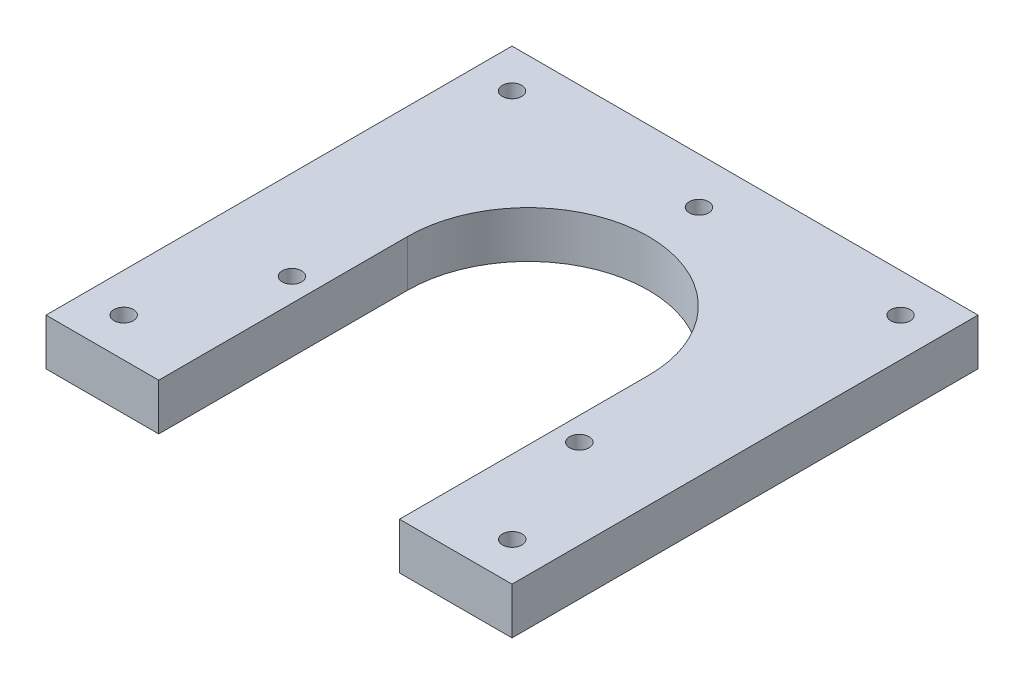
ISO-10303-21;
HEADER;
FILE_DESCRIPTION(('STEP AP214'),'2;1');
FILE_NAME('part.step','',(''),(''),'','','');
FILE_SCHEMA(('AUTOMOTIVE_DESIGN { 1 0 10303 214 1 1 1 1 }'));
ENDSEC;
DATA;
#1=APPLICATION_CONTEXT('core data for automotive mechanical design processes');
#2=APPLICATION_PROTOCOL_DEFINITION('international standard','automotive_design',2000,#1);
#3=PRODUCT_CONTEXT('',#1,'mechanical');
#4=PRODUCT('Part','Part','',(#3));
#5=PRODUCT_RELATED_PRODUCT_CATEGORY('part','',(#4));
#6=PRODUCT_DEFINITION_FORMATION('','',#4);
#7=PRODUCT_DEFINITION_CONTEXT('part definition',#1,'design');
#8=PRODUCT_DEFINITION('design','',#6,#7);
#9=PRODUCT_DEFINITION_SHAPE('','',#8);
#10=(LENGTH_UNIT() NAMED_UNIT(*) SI_UNIT(.MILLI.,.METRE.));
#11=(NAMED_UNIT(*) PLANE_ANGLE_UNIT() SI_UNIT($,.RADIAN.));
#12=(NAMED_UNIT(*) SI_UNIT($,.STERADIAN.) SOLID_ANGLE_UNIT());
#13=UNCERTAINTY_MEASURE_WITH_UNIT(LENGTH_MEASURE(1.E-05),#10,'distance_accuracy_value','');
#14=(GEOMETRIC_REPRESENTATION_CONTEXT(3) GLOBAL_UNCERTAINTY_ASSIGNED_CONTEXT((#13)) GLOBAL_UNIT_ASSIGNED_CONTEXT((#10,
#11,#12)) REPRESENTATION_CONTEXT('',''));
#15=CARTESIAN_POINT('',(0.,0.,0.));
#16=DIRECTION('',(0.,0.,1.));
#17=DIRECTION('',(1.,0.,0.));
#18=AXIS2_PLACEMENT_3D('',#15,#16,#17);
#19=CARTESIAN_POINT('',(0.,0.,63.));
#20=DIRECTION('',(0.,0.,1.));
#21=DIRECTION('',(1.,0.,0.));
#22=AXIS2_PLACEMENT_3D('',#19,#20,#21);
#23=PLANE('',#22);
#24=DIRECTION('',(0.,1.,0.));
#25=VECTOR('',#24,1.);
#26=CARTESIAN_POINT('',(31.5127197729334,0.,63.));
#27=LINE('',#26,#25);
#28=CARTESIAN_POINT('',(31.5127197729334,0.,63.));
#29=VERTEX_POINT('',#28);
#30=CARTESIAN_POINT('',(31.5127197729334,6.,63.));
#31=VERTEX_POINT('',#30);
#32=EDGE_CURVE('E11',#29,#31,#27,.T.);
#33=ORIENTED_EDGE('',*,*,#32,.F.);
#34=DIRECTION('',(1.,0.,0.));
#35=VECTOR('',#34,1.);
#36=CARTESIAN_POINT('',(-14.,0.,63.));
#37=LINE('',#36,#35);
#38=CARTESIAN_POINT('',(46.,0.,63.));
#39=VERTEX_POINT('',#38);
#40=EDGE_CURVE('E267',#29,#39,#37,.T.);
#41=ORIENTED_EDGE('',*,*,#40,.T.);
#42=DIRECTION('',(0.,1.,0.));
#43=VECTOR('',#42,1.);
#44=CARTESIAN_POINT('',(46.,6.,63.));
#45=LINE('',#44,#43);
#46=CARTESIAN_POINT('',(46.,6.,63.));
#47=VERTEX_POINT('',#46);
#48=EDGE_CURVE('E270',#39,#47,#45,.T.);
#49=ORIENTED_EDGE('',*,*,#48,.T.);
#50=DIRECTION('',(-1.,0.,0.));
#51=VECTOR('',#50,1.);
#52=CARTESIAN_POINT('',(-14.,6.,63.));
#53=LINE('',#52,#51);
#54=EDGE_CURVE('E273',#47,#31,#53,.T.);
#55=ORIENTED_EDGE('',*,*,#54,.T.);
#56=EDGE_LOOP('',(#33,#41,#49,#55));
#57=FACE_BOUND('',#56,.T.);
#58=ADVANCED_FACE('F51',(#57),#23,.T.);
#59=CARTESIAN_POINT('',(-14.,6.,63.));
#60=DIRECTION('',(1.,0.,0.));
#61=DIRECTION('',(0.,0.,-1.));
#62=AXIS2_PLACEMENT_3D('',#59,#60,#61);
#63=PLANE('',#62);
#64=CARTESIAN_POINT('',(-14.,3.,14.94));
#65=DIRECTION('',(-1.,0.,0.));
#66=DIRECTION('',(0.,0.,1.));
#67=AXIS2_PLACEMENT_3D('',#64,#65,#66);
#68=CIRCLE('',#67,1.24999999999999);
#69=CARTESIAN_POINT('',(-14.,3.,16.19));
#70=VERTEX_POINT('',#69);
#71=EDGE_CURVE('E149',#70,#70,#68,.T.);
#72=ORIENTED_EDGE('',*,*,#71,.F.);
#73=EDGE_LOOP('',(#72));
#74=FACE_BOUND('',#73,.T.);
#75=CARTESIAN_POINT('',(-14.,3.,46.94));
#76=DIRECTION('',(-1.,0.,0.));
#77=DIRECTION('',(0.,0.,1.));
#78=AXIS2_PLACEMENT_3D('',#75,#76,#77);
#79=CIRCLE('',#78,1.24999999999999);
#80=CARTESIAN_POINT('',(-14.,3.,48.19));
#81=VERTEX_POINT('',#80);
#82=EDGE_CURVE('E148',#81,#81,#79,.T.);
#83=ORIENTED_EDGE('',*,*,#82,.F.);
#84=EDGE_LOOP('',(#83));
#85=FACE_BOUND('',#84,.T.);
#86=DIRECTION('',(0.,-1.,0.));
#87=VECTOR('',#86,1.);
#88=CARTESIAN_POINT('',(-14.,6.,3.));
#89=LINE('',#88,#87);
#90=CARTESIAN_POINT('',(-14.,6.,3.));
#91=VERTEX_POINT('',#90);
#92=CARTESIAN_POINT('',(-14.,0.,3.));
#93=VERTEX_POINT('',#92);
#94=EDGE_CURVE('E263',#91,#93,#89,.T.);
#95=ORIENTED_EDGE('',*,*,#94,.T.);
#96=DIRECTION('',(0.,0.,-1.));
#97=VECTOR('',#96,1.);
#98=CARTESIAN_POINT('',(-14.,0.,63.));
#99=LINE('',#98,#97);
#100=CARTESIAN_POINT('',(-14.,0.,63.));
#101=VERTEX_POINT('',#100);
#102=EDGE_CURVE('E298',#101,#93,#99,.T.);
#103=ORIENTED_EDGE('',*,*,#102,.F.);
#104=DIRECTION('',(0.,-1.,0.));
#105=VECTOR('',#104,1.);
#106=CARTESIAN_POINT('',(-14.,6.,63.));
#107=LINE('',#106,#105);
#108=CARTESIAN_POINT('',(-14.,6.,63.));
#109=VERTEX_POINT('',#108);
#110=EDGE_CURVE('E264',#109,#101,#107,.T.);
#111=ORIENTED_EDGE('',*,*,#110,.F.);
#112=DIRECTION('',(0.,0.,-1.));
#113=VECTOR('',#112,1.);
#114=CARTESIAN_POINT('',(-14.,6.,63.));
#115=LINE('',#114,#113);
#116=EDGE_CURVE('E277',#109,#91,#115,.T.);
#117=ORIENTED_EDGE('',*,*,#116,.T.);
#118=EDGE_LOOP('',(#95,#103,#111,#117));
#119=FACE_BOUND('',#118,.T.);
#120=ADVANCED_FACE('F53',(#74,#85,#119),#63,.F.);
#121=CARTESIAN_POINT('',(-14.,0.,63.));
#122=DIRECTION('',(0.,1.,0.));
#123=DIRECTION('',(0.,0.,1.));
#124=AXIS2_PLACEMENT_3D('',#121,#122,#123);
#125=PLANE('',#124);
#126=CARTESIAN_POINT('',(-9.,0.,58.));
#127=DIRECTION('',(0.,-1.,0.));
#128=DIRECTION('',(0.,0.,-1.));
#129=AXIS2_PLACEMENT_3D('',#126,#127,#128);
#130=CIRCLE('',#129,1.25);
#131=CARTESIAN_POINT('',(-9.,0.,56.75));
#132=VERTEX_POINT('',#131);
#133=EDGE_CURVE('E164',#132,#132,#130,.T.);
#134=ORIENTED_EDGE('',*,*,#133,.F.);
#135=EDGE_LOOP('',(#134));
#136=FACE_BOUND('',#135,.T.);
#137=CARTESIAN_POINT('',(-8.99999999999999,0.,8.));
#138=DIRECTION('',(0.,-1.,0.));
#139=DIRECTION('',(0.,0.,-1.));
#140=AXIS2_PLACEMENT_3D('',#137,#138,#139);
#141=CIRCLE('',#140,1.25);
#142=CARTESIAN_POINT('',(-8.99999999999999,0.,6.75));
#143=VERTEX_POINT('',#142);
#144=EDGE_CURVE('E172',#143,#143,#141,.T.);
#145=ORIENTED_EDGE('',*,*,#144,.F.);
#146=EDGE_LOOP('',(#145));
#147=FACE_BOUND('',#146,.T.);
#148=CARTESIAN_POINT('',(41.0254395458668,0.,8.));
#149=DIRECTION('',(0.,-1.,0.));
#150=DIRECTION('',(0.,0.,-1.));
#151=AXIS2_PLACEMENT_3D('',#148,#149,#150);
#152=CIRCLE('',#151,1.25);
#153=CARTESIAN_POINT('',(41.0254395458668,0.,6.75));
#154=VERTEX_POINT('',#153);
#155=EDGE_CURVE('E180',#154,#154,#152,.T.);
#156=ORIENTED_EDGE('',*,*,#155,.F.);
#157=EDGE_LOOP('',(#156));
#158=FACE_BOUND('',#157,.T.);
#159=CARTESIAN_POINT('',(41.0254395458668,0.,58.));
#160=DIRECTION('',(0.,-1.,0.));
#161=DIRECTION('',(0.,0.,-1.));
#162=AXIS2_PLACEMENT_3D('',#159,#160,#161);
#163=CIRCLE('',#162,1.25);
#164=CARTESIAN_POINT('',(41.0254395458668,0.,56.75));
#165=VERTEX_POINT('',#164);
#166=EDGE_CURVE('E188',#165,#165,#163,.T.);
#167=ORIENTED_EDGE('',*,*,#166,.F.);
#168=EDGE_LOOP('',(#167));
#169=FACE_BOUND('',#168,.T.);
#170=CARTESIAN_POINT('',(-2.48728022706658,0.,42.8458808997907));
#171=DIRECTION('',(0.,-1.,0.));
#172=DIRECTION('',(0.,0.,-1.));
#173=AXIS2_PLACEMENT_3D('',#170,#171,#172);
#174=CIRCLE('',#173,1.25);
#175=CARTESIAN_POINT('',(-2.48728022706658,0.,41.5958808997906));
#176=VERTEX_POINT('',#175);
#177=EDGE_CURVE('E196',#176,#176,#174,.T.);
#178=ORIENTED_EDGE('',*,*,#177,.F.);
#179=EDGE_LOOP('',(#178));
#180=FACE_BOUND('',#179,.T.);
#181=CARTESIAN_POINT('',(16.0127197729334,0.,8.94));
#182=DIRECTION('',(0.,-1.,0.));
#183=DIRECTION('',(0.,0.,-1.));
#184=AXIS2_PLACEMENT_3D('',#181,#182,#183);
#185=CIRCLE('',#184,1.25);
#186=CARTESIAN_POINT('',(16.0127197729334,0.,7.69));
#187=VERTEX_POINT('',#186);
#188=EDGE_CURVE('E204',#187,#187,#185,.T.);
#189=ORIENTED_EDGE('',*,*,#188,.F.);
#190=EDGE_LOOP('',(#189));
#191=FACE_BOUND('',#190,.T.);
#192=CARTESIAN_POINT('',(34.5127197729334,0.,42.8458808997907));
#193=DIRECTION('',(0.,-1.,0.));
#194=DIRECTION('',(0.,0.,-1.));
#195=AXIS2_PLACEMENT_3D('',#192,#193,#194);
#196=CIRCLE('',#195,1.25);
#197=CARTESIAN_POINT('',(34.5127197729334,0.,41.5958808997907));
#198=VERTEX_POINT('',#197);
#199=EDGE_CURVE('E212',#198,#198,#196,.T.);
#200=ORIENTED_EDGE('',*,*,#199,.F.);
#201=EDGE_LOOP('',(#200));
#202=FACE_BOUND('',#201,.T.);
#203=ORIENTED_EDGE('',*,*,#40,.F.);
#204=DIRECTION('',(0.,0.,-1.));
#205=VECTOR('',#204,1.);
#206=CARTESIAN_POINT('',(31.5127197729334,0.,63.));
#207=LINE('',#206,#205);
#208=CARTESIAN_POINT('',(31.5127197729334,0.,30.94));
#209=VERTEX_POINT('',#208);
#210=EDGE_CURVE('E239',#29,#209,#207,.T.);
#211=ORIENTED_EDGE('',*,*,#210,.T.);
#212=CARTESIAN_POINT('',(16.0127197729334,0.,30.94));
#213=DIRECTION('',(0.,1.,0.));
#214=DIRECTION('',(0.,0.,1.));
#215=AXIS2_PLACEMENT_3D('',#212,#213,#214);
#216=CIRCLE('',#215,15.5);
#217=CARTESIAN_POINT('',(0.512719772933413,0.,30.94));
#218=VERTEX_POINT('',#217);
#219=EDGE_CURVE('E243',#209,#218,#216,.T.);
#220=ORIENTED_EDGE('',*,*,#219,.T.);
#221=DIRECTION('',(0.,0.,1.));
#222=VECTOR('',#221,1.);
#223=CARTESIAN_POINT('',(0.512719772933422,0.,63.));
#224=LINE('',#223,#222);
#225=CARTESIAN_POINT('',(0.512719772933422,0.,63.));
#226=VERTEX_POINT('',#225);
#227=EDGE_CURVE('E234',#218,#226,#224,.T.);
#228=ORIENTED_EDGE('',*,*,#227,.T.);
#229=EDGE_CURVE('E105',#101,#226,#37,.T.);
#230=ORIENTED_EDGE('',*,*,#229,.F.);
#231=ORIENTED_EDGE('',*,*,#102,.T.);
#232=DIRECTION('',(1.,0.,0.));
#233=VECTOR('',#232,1.);
#234=CARTESIAN_POINT('',(-14.,0.,3.));
#235=LINE('',#234,#233);
#236=CARTESIAN_POINT('',(46.,0.,3.));
#237=VERTEX_POINT('',#236);
#238=EDGE_CURVE('E281',#93,#237,#235,.T.);
#239=ORIENTED_EDGE('',*,*,#238,.T.);
#240=DIRECTION('',(0.,0.,-1.));
#241=VECTOR('',#240,1.);
#242=CARTESIAN_POINT('',(46.,0.,63.));
#243=LINE('',#242,#241);
#244=EDGE_CURVE('E294',#39,#237,#243,.T.);
#245=ORIENTED_EDGE('',*,*,#244,.F.);
#246=EDGE_LOOP('',(#203,#211,#220,#228,#230,#231,#239,#245));
#247=FACE_BOUND('',#246,.T.);
#248=ADVANCED_FACE('F306',(#136,#147,#158,#169,#180,#191,#202,#247),#125,.F.);
#249=CARTESIAN_POINT('',(46.,6.,63.));
#250=DIRECTION('',(-1.,0.,0.));
#251=DIRECTION('',(0.,0.,1.));
#252=AXIS2_PLACEMENT_3D('',#249,#250,#251);
#253=PLANE('',#252);
#254=DIRECTION('',(0.,1.,0.));
#255=VECTOR('',#254,1.);
#256=CARTESIAN_POINT('',(46.,6.,3.));
#257=LINE('',#256,#255);
#258=CARTESIAN_POINT('',(46.,6.,3.));
#259=VERTEX_POINT('',#258);
#260=EDGE_CURVE('E284',#237,#259,#257,.T.);
#261=ORIENTED_EDGE('',*,*,#260,.T.);
#262=DIRECTION('',(0.,0.,-1.));
#263=VECTOR('',#262,1.);
#264=CARTESIAN_POINT('',(46.,6.,63.));
#265=LINE('',#264,#263);
#266=EDGE_CURVE('E291',#47,#259,#265,.T.);
#267=ORIENTED_EDGE('',*,*,#266,.F.);
#268=ORIENTED_EDGE('',*,*,#48,.F.);
#269=ORIENTED_EDGE('',*,*,#244,.T.);
#270=EDGE_LOOP('',(#261,#267,#268,#269));
#271=FACE_BOUND('',#270,.T.);
#272=ADVANCED_FACE('F317',(#271),#253,.F.);
#273=CARTESIAN_POINT('',(-14.,6.,63.));
#274=DIRECTION('',(0.,-1.,0.));
#275=DIRECTION('',(0.,0.,-1.));
#276=AXIS2_PLACEMENT_3D('',#273,#274,#275);
#277=PLANE('',#276);
#278=CARTESIAN_POINT('',(-9.,6.,58.));
#279=DIRECTION('',(0.,-1.,0.));
#280=DIRECTION('',(0.,0.,-1.));
#281=AXIS2_PLACEMENT_3D('',#278,#279,#280);
#282=CIRCLE('',#281,1.25);
#283=CARTESIAN_POINT('',(-9.,6.,56.75));
#284=VERTEX_POINT('',#283);
#285=EDGE_CURVE('E168',#284,#284,#282,.T.);
#286=ORIENTED_EDGE('',*,*,#285,.T.);
#287=EDGE_LOOP('',(#286));
#288=FACE_BOUND('',#287,.T.);
#289=CARTESIAN_POINT('',(-8.99999999999999,6.,8.));
#290=DIRECTION('',(0.,-1.,0.));
#291=DIRECTION('',(0.,0.,-1.));
#292=AXIS2_PLACEMENT_3D('',#289,#290,#291);
#293=CIRCLE('',#292,1.25);
#294=CARTESIAN_POINT('',(-8.99999999999999,6.,6.75));
#295=VERTEX_POINT('',#294);
#296=EDGE_CURVE('E176',#295,#295,#293,.T.);
#297=ORIENTED_EDGE('',*,*,#296,.T.);
#298=EDGE_LOOP('',(#297));
#299=FACE_BOUND('',#298,.T.);
#300=CARTESIAN_POINT('',(41.0254395458668,6.,8.));
#301=DIRECTION('',(0.,-1.,0.));
#302=DIRECTION('',(0.,0.,-1.));
#303=AXIS2_PLACEMENT_3D('',#300,#301,#302);
#304=CIRCLE('',#303,1.25);
#305=CARTESIAN_POINT('',(41.0254395458668,6.,6.75));
#306=VERTEX_POINT('',#305);
#307=EDGE_CURVE('E184',#306,#306,#304,.T.);
#308=ORIENTED_EDGE('',*,*,#307,.T.);
#309=EDGE_LOOP('',(#308));
#310=FACE_BOUND('',#309,.T.);
#311=CARTESIAN_POINT('',(41.0254395458668,6.,58.));
#312=DIRECTION('',(0.,-1.,0.));
#313=DIRECTION('',(0.,0.,-1.));
#314=AXIS2_PLACEMENT_3D('',#311,#312,#313);
#315=CIRCLE('',#314,1.25);
#316=CARTESIAN_POINT('',(41.0254395458668,6.,56.75));
#317=VERTEX_POINT('',#316);
#318=EDGE_CURVE('E192',#317,#317,#315,.T.);
#319=ORIENTED_EDGE('',*,*,#318,.T.);
#320=EDGE_LOOP('',(#319));
#321=FACE_BOUND('',#320,.T.);
#322=CARTESIAN_POINT('',(-2.48728022706658,6.,42.8458808997907));
#323=DIRECTION('',(0.,-1.,0.));
#324=DIRECTION('',(0.,0.,-1.));
#325=AXIS2_PLACEMENT_3D('',#322,#323,#324);
#326=CIRCLE('',#325,1.25);
#327=CARTESIAN_POINT('',(-2.48728022706658,6.,41.5958808997906));
#328=VERTEX_POINT('',#327);
#329=EDGE_CURVE('E200',#328,#328,#326,.T.);
#330=ORIENTED_EDGE('',*,*,#329,.T.);
#331=EDGE_LOOP('',(#330));
#332=FACE_BOUND('',#331,.T.);
#333=CARTESIAN_POINT('',(16.0127197729334,6.,8.94));
#334=DIRECTION('',(0.,-1.,0.));
#335=DIRECTION('',(0.,0.,-1.));
#336=AXIS2_PLACEMENT_3D('',#333,#334,#335);
#337=CIRCLE('',#336,1.25);
#338=CARTESIAN_POINT('',(16.0127197729334,6.,7.69));
#339=VERTEX_POINT('',#338);
#340=EDGE_CURVE('E208',#339,#339,#337,.T.);
#341=ORIENTED_EDGE('',*,*,#340,.T.);
#342=EDGE_LOOP('',(#341));
#343=FACE_BOUND('',#342,.T.);
#344=CARTESIAN_POINT('',(34.5127197729334,6.,42.8458808997907));
#345=DIRECTION('',(0.,-1.,0.));
#346=DIRECTION('',(0.,0.,-1.));
#347=AXIS2_PLACEMENT_3D('',#344,#345,#346);
#348=CIRCLE('',#347,1.25);
#349=CARTESIAN_POINT('',(34.5127197729334,6.,41.5958808997907));
#350=VERTEX_POINT('',#349);
#351=EDGE_CURVE('E216',#350,#350,#348,.T.);
#352=ORIENTED_EDGE('',*,*,#351,.T.);
#353=EDGE_LOOP('',(#352));
#354=FACE_BOUND('',#353,.T.);
#355=CARTESIAN_POINT('',(16.0127197729334,6.,30.94));
#356=DIRECTION('',(0.,1.,0.));
#357=DIRECTION('',(0.,0.,1.));
#358=AXIS2_PLACEMENT_3D('',#355,#356,#357);
#359=CIRCLE('',#358,15.5);
#360=CARTESIAN_POINT('',(31.5127197729334,6.,30.94));
#361=VERTEX_POINT('',#360);
#362=CARTESIAN_POINT('',(0.512719772933413,6.,30.94));
#363=VERTEX_POINT('',#362);
#364=EDGE_CURVE('E220',#361,#363,#359,.T.);
#365=ORIENTED_EDGE('',*,*,#364,.F.);
#366=DIRECTION('',(0.,0.,-1.));
#367=VECTOR('',#366,1.);
#368=CARTESIAN_POINT('',(31.5127197729334,6.,30.94));
#369=LINE('',#368,#367);
#370=EDGE_CURVE('E226',#31,#361,#369,.T.);
#371=ORIENTED_EDGE('',*,*,#370,.F.);
#372=ORIENTED_EDGE('',*,*,#54,.F.);
#373=ORIENTED_EDGE('',*,*,#266,.T.);
#374=DIRECTION('',(-1.,0.,0.));
#375=VECTOR('',#374,1.);
#376=CARTESIAN_POINT('',(-14.,6.,3.));
#377=LINE('',#376,#375);
#378=EDGE_CURVE('E97',#259,#91,#377,.T.);
#379=ORIENTED_EDGE('',*,*,#378,.T.);
#380=ORIENTED_EDGE('',*,*,#116,.F.);
#381=CARTESIAN_POINT('',(0.512719772933413,6.,63.));
#382=VERTEX_POINT('',#381);
#383=EDGE_CURVE('E75',#382,#109,#53,.T.);
#384=ORIENTED_EDGE('',*,*,#383,.F.);
#385=DIRECTION('',(0.,0.,1.));
#386=VECTOR('',#385,1.);
#387=CARTESIAN_POINT('',(0.512719772933413,6.,30.94));
#388=LINE('',#387,#386);
#389=EDGE_CURVE('E67',#363,#382,#388,.T.);
#390=ORIENTED_EDGE('',*,*,#389,.F.);
#391=EDGE_LOOP('',(#365,#371,#372,#373,#379,#380,#384,#390));
#392=FACE_BOUND('',#391,.T.);
#393=ADVANCED_FACE('F331',(#288,#299,#310,#321,#332,#343,#354,#392),#277,.F.);
#394=DIRECTION('',(0.,-1.,0.));
#395=VECTOR('',#394,1.);
#396=CARTESIAN_POINT('',(0.512719772933422,0.,63.));
#397=LINE('',#396,#395);
#398=EDGE_CURVE('E60',#382,#226,#397,.T.);
#399=ORIENTED_EDGE('',*,*,#398,.F.);
#400=ORIENTED_EDGE('',*,*,#383,.T.);
#401=ORIENTED_EDGE('',*,*,#110,.T.);
#402=ORIENTED_EDGE('',*,*,#229,.T.);
#403=EDGE_LOOP('',(#399,#400,#401,#402));
#404=FACE_BOUND('',#403,.T.);
#405=ADVANCED_FACE('F307',(#404),#23,.T.);
#406=CARTESIAN_POINT('',(0.,0.,3.));
#407=DIRECTION('',(0.,0.,1.));
#408=DIRECTION('',(1.,0.,0.));
#409=AXIS2_PLACEMENT_3D('',#406,#407,#408);
#410=PLANE('',#409);
#411=CARTESIAN_POINT('',(29.,3.,3.));
#412=DIRECTION('',(0.,0.,-1.));
#413=DIRECTION('',(-1.,0.,0.));
#414=AXIS2_PLACEMENT_3D('',#411,#412,#413);
#415=CIRCLE('',#414,1.24999999999999);
#416=CARTESIAN_POINT('',(27.75,3.,3.));
#417=VERTEX_POINT('',#416);
#418=EDGE_CURVE('E247',#417,#417,#415,.T.);
#419=ORIENTED_EDGE('',*,*,#418,.F.);
#420=EDGE_LOOP('',(#419));
#421=FACE_BOUND('',#420,.T.);
#422=CARTESIAN_POINT('',(3.,3.,3.));
#423=DIRECTION('',(0.,0.,-1.));
#424=DIRECTION('',(-1.,0.,0.));
#425=AXIS2_PLACEMENT_3D('',#422,#423,#424);
#426=CIRCLE('',#425,1.24999999999999);
#427=CARTESIAN_POINT('',(1.75000000000001,3.,3.));
#428=VERTEX_POINT('',#427);
#429=EDGE_CURVE('E255',#428,#428,#426,.T.);
#430=ORIENTED_EDGE('',*,*,#429,.F.);
#431=EDGE_LOOP('',(#430));
#432=FACE_BOUND('',#431,.T.);
#433=ORIENTED_EDGE('',*,*,#94,.F.);
#434=ORIENTED_EDGE('',*,*,#378,.F.);
#435=ORIENTED_EDGE('',*,*,#260,.F.);
#436=ORIENTED_EDGE('',*,*,#238,.F.);
#437=EDGE_LOOP('',(#433,#434,#435,#436));
#438=FACE_BOUND('',#437,.T.);
#439=ADVANCED_FACE('F319',(#421,#432,#438),#410,.F.);
#440=CARTESIAN_POINT('',(3.,3.,10.5));
#441=DIRECTION('',(0.,0.,-1.));
#442=DIRECTION('',(-1.,0.,0.));
#443=AXIS2_PLACEMENT_3D('',#440,#441,#442);
#444=CONICAL_SURFACE('',#443,1.24999999999999,1.02974425867665);
#445=CARTESIAN_POINT('',(3.,3.,11.2510757737844));
#446=VERTEX_POINT('',#445);
#447=VERTEX_LOOP('',#446);
#448=FACE_BOUND('',#447,.T.);
#449=CARTESIAN_POINT('',(3.,3.,10.5));
#450=DIRECTION('',(0.,0.,-1.));
#451=DIRECTION('',(-1.,0.,0.));
#452=AXIS2_PLACEMENT_3D('',#449,#450,#451);
#453=CIRCLE('',#452,1.24999999999999);
#454=CARTESIAN_POINT('',(1.75000000000001,3.,10.5));
#455=VERTEX_POINT('',#454);
#456=EDGE_CURVE('E259',#455,#455,#453,.T.);
#457=ORIENTED_EDGE('',*,*,#456,.T.);
#458=EDGE_LOOP('',(#457));
#459=FACE_BOUND('',#458,.T.);
#460=ADVANCED_FACE('F321',(#448,#459),#444,.F.);
#461=CARTESIAN_POINT('',(3.,3.,3.));
#462=DIRECTION('',(0.,0.,-1.));
#463=DIRECTION('',(-1.,0.,0.));
#464=AXIS2_PLACEMENT_3D('',#461,#462,#463);
#465=CYLINDRICAL_SURFACE('',#464,1.24999999999999);
#466=ORIENTED_EDGE('',*,*,#456,.F.);
#467=EDGE_LOOP('',(#466));
#468=FACE_BOUND('',#467,.T.);
#469=ORIENTED_EDGE('',*,*,#429,.T.);
#470=EDGE_LOOP('',(#469));
#471=FACE_BOUND('',#470,.T.);
#472=ADVANCED_FACE('F328',(#468,#471),#465,.F.);
#473=CARTESIAN_POINT('',(29.,3.,10.5));
#474=DIRECTION('',(0.,0.,-1.));
#475=DIRECTION('',(-1.,0.,0.));
#476=AXIS2_PLACEMENT_3D('',#473,#474,#475);
#477=CONICAL_SURFACE('',#476,1.24999999999999,1.02974425867665);
#478=CARTESIAN_POINT('',(29.,3.,11.2510757737844));
#479=VERTEX_POINT('',#478);
#480=VERTEX_LOOP('',#479);
#481=FACE_BOUND('',#480,.T.);
#482=CARTESIAN_POINT('',(29.,3.,10.5));
#483=DIRECTION('',(0.,0.,-1.));
#484=DIRECTION('',(-1.,0.,0.));
#485=AXIS2_PLACEMENT_3D('',#482,#483,#484);
#486=CIRCLE('',#485,1.24999999999999);
#487=CARTESIAN_POINT('',(27.75,3.,10.5));
#488=VERTEX_POINT('',#487);
#489=EDGE_CURVE('E251',#488,#488,#486,.T.);
#490=ORIENTED_EDGE('',*,*,#489,.T.);
#491=EDGE_LOOP('',(#490));
#492=FACE_BOUND('',#491,.T.);
#493=ADVANCED_FACE('F346',(#481,#492),#477,.F.);
#494=CARTESIAN_POINT('',(29.,3.,3.));
#495=DIRECTION('',(0.,0.,-1.));
#496=DIRECTION('',(-1.,0.,0.));
#497=AXIS2_PLACEMENT_3D('',#494,#495,#496);
#498=CYLINDRICAL_SURFACE('',#497,1.24999999999999);
#499=ORIENTED_EDGE('',*,*,#489,.F.);
#500=EDGE_LOOP('',(#499));
#501=FACE_BOUND('',#500,.T.);
#502=ORIENTED_EDGE('',*,*,#418,.T.);
#503=EDGE_LOOP('',(#502));
#504=FACE_BOUND('',#503,.T.);
#505=ADVANCED_FACE('F350',(#501,#504),#498,.F.);
#506=CARTESIAN_POINT('',(16.0127197729334,-54.,30.94));
#507=DIRECTION('',(0.,1.,0.));
#508=DIRECTION('',(0.,0.,1.));
#509=AXIS2_PLACEMENT_3D('',#506,#507,#508);
#510=CYLINDRICAL_SURFACE('',#509,15.5);
#511=DIRECTION('',(0.,1.,0.));
#512=VECTOR('',#511,1.);
#513=CARTESIAN_POINT('',(31.5127197729334,-54.,30.94));
#514=LINE('',#513,#512);
#515=EDGE_CURVE('E231',#209,#361,#514,.T.);
#516=ORIENTED_EDGE('',*,*,#515,.T.);
#517=ORIENTED_EDGE('',*,*,#364,.T.);
#518=DIRECTION('',(0.,1.,0.));
#519=VECTOR('',#518,1.);
#520=CARTESIAN_POINT('',(0.512719772933413,-54.,30.94));
#521=LINE('',#520,#519);
#522=EDGE_CURVE('E230',#218,#363,#521,.T.);
#523=ORIENTED_EDGE('',*,*,#522,.F.);
#524=ORIENTED_EDGE('',*,*,#219,.F.);
#525=EDGE_LOOP('',(#516,#517,#523,#524));
#526=FACE_BOUND('',#525,.T.);
#527=ADVANCED_FACE('F354',(#526),#510,.F.);
#528=CARTESIAN_POINT('',(31.5127197729334,-54.,30.94));
#529=DIRECTION('',(1.,0.,0.));
#530=DIRECTION('',(0.,0.,-1.));
#531=AXIS2_PLACEMENT_3D('',#528,#529,#530);
#532=PLANE('',#531);
#533=ORIENTED_EDGE('',*,*,#32,.T.);
#534=ORIENTED_EDGE('',*,*,#370,.T.);
#535=ORIENTED_EDGE('',*,*,#515,.F.);
#536=ORIENTED_EDGE('',*,*,#210,.F.);
#537=EDGE_LOOP('',(#533,#534,#535,#536));
#538=FACE_BOUND('',#537,.T.);
#539=ADVANCED_FACE('F358',(#538),#532,.F.);
#540=CARTESIAN_POINT('',(0.512719772933413,-54.,30.94));
#541=DIRECTION('',(-1.,0.,0.));
#542=DIRECTION('',(0.,0.,1.));
#543=AXIS2_PLACEMENT_3D('',#540,#541,#542);
#544=PLANE('',#543);
#545=ORIENTED_EDGE('',*,*,#522,.T.);
#546=ORIENTED_EDGE('',*,*,#389,.T.);
#547=ORIENTED_EDGE('',*,*,#398,.T.);
#548=ORIENTED_EDGE('',*,*,#227,.F.);
#549=EDGE_LOOP('',(#545,#546,#547,#548));
#550=FACE_BOUND('',#549,.T.);
#551=ADVANCED_FACE('F303',(#550),#544,.F.);
#552=CARTESIAN_POINT('',(34.5127197729334,0.,42.8458808997907));
#553=DIRECTION('',(0.,-1.,0.));
#554=DIRECTION('',(0.,0.,-1.));
#555=AXIS2_PLACEMENT_3D('',#552,#553,#554);
#556=CYLINDRICAL_SURFACE('',#555,1.25);
#557=ORIENTED_EDGE('',*,*,#351,.F.);
#558=EDGE_LOOP('',(#557));
#559=FACE_BOUND('',#558,.T.);
#560=ORIENTED_EDGE('',*,*,#199,.T.);
#561=EDGE_LOOP('',(#560));
#562=FACE_BOUND('',#561,.T.);
#563=ADVANCED_FACE('F362',(#559,#562),#556,.F.);
#564=CARTESIAN_POINT('',(16.0127197729334,0.,8.94));
#565=DIRECTION('',(0.,-1.,0.));
#566=DIRECTION('',(0.,0.,-1.));
#567=AXIS2_PLACEMENT_3D('',#564,#565,#566);
#568=CYLINDRICAL_SURFACE('',#567,1.25);
#569=ORIENTED_EDGE('',*,*,#340,.F.);
#570=EDGE_LOOP('',(#569));
#571=FACE_BOUND('',#570,.T.);
#572=ORIENTED_EDGE('',*,*,#188,.T.);
#573=EDGE_LOOP('',(#572));
#574=FACE_BOUND('',#573,.T.);
#575=ADVANCED_FACE('F368',(#571,#574),#568,.F.);
#576=CARTESIAN_POINT('',(-2.48728022706658,0.,42.8458808997907));
#577=DIRECTION('',(0.,-1.,0.));
#578=DIRECTION('',(0.,0.,-1.));
#579=AXIS2_PLACEMENT_3D('',#576,#577,#578);
#580=CYLINDRICAL_SURFACE('',#579,1.25);
#581=ORIENTED_EDGE('',*,*,#329,.F.);
#582=EDGE_LOOP('',(#581));
#583=FACE_BOUND('',#582,.T.);
#584=ORIENTED_EDGE('',*,*,#177,.T.);
#585=EDGE_LOOP('',(#584));
#586=FACE_BOUND('',#585,.T.);
#587=ADVANCED_FACE('F372',(#583,#586),#580,.F.);
#588=CARTESIAN_POINT('',(41.0254395458668,0.,58.));
#589=DIRECTION('',(0.,-1.,0.));
#590=DIRECTION('',(0.,0.,-1.));
#591=AXIS2_PLACEMENT_3D('',#588,#589,#590);
#592=CYLINDRICAL_SURFACE('',#591,1.25);
#593=ORIENTED_EDGE('',*,*,#318,.F.);
#594=EDGE_LOOP('',(#593));
#595=FACE_BOUND('',#594,.T.);
#596=ORIENTED_EDGE('',*,*,#166,.T.);
#597=EDGE_LOOP('',(#596));
#598=FACE_BOUND('',#597,.T.);
#599=ADVANCED_FACE('F376',(#595,#598),#592,.F.);
#600=CARTESIAN_POINT('',(41.0254395458668,0.,8.));
#601=DIRECTION('',(0.,-1.,0.));
#602=DIRECTION('',(0.,0.,-1.));
#603=AXIS2_PLACEMENT_3D('',#600,#601,#602);
#604=CYLINDRICAL_SURFACE('',#603,1.25);
#605=ORIENTED_EDGE('',*,*,#307,.F.);
#606=EDGE_LOOP('',(#605));
#607=FACE_BOUND('',#606,.T.);
#608=ORIENTED_EDGE('',*,*,#155,.T.);
#609=EDGE_LOOP('',(#608));
#610=FACE_BOUND('',#609,.T.);
#611=ADVANCED_FACE('F380',(#607,#610),#604,.F.);
#612=CARTESIAN_POINT('',(-8.99999999999999,0.,8.));
#613=DIRECTION('',(0.,-1.,0.));
#614=DIRECTION('',(0.,0.,-1.));
#615=AXIS2_PLACEMENT_3D('',#612,#613,#614);
#616=CYLINDRICAL_SURFACE('',#615,1.25);
#617=ORIENTED_EDGE('',*,*,#296,.F.);
#618=EDGE_LOOP('',(#617));
#619=FACE_BOUND('',#618,.T.);
#620=ORIENTED_EDGE('',*,*,#144,.T.);
#621=EDGE_LOOP('',(#620));
#622=FACE_BOUND('',#621,.T.);
#623=ADVANCED_FACE('F384',(#619,#622),#616,.F.);
#624=CARTESIAN_POINT('',(-9.,0.,58.));
#625=DIRECTION('',(0.,-1.,0.));
#626=DIRECTION('',(0.,0.,-1.));
#627=AXIS2_PLACEMENT_3D('',#624,#625,#626);
#628=CYLINDRICAL_SURFACE('',#627,1.25);
#629=ORIENTED_EDGE('',*,*,#285,.F.);
#630=EDGE_LOOP('',(#629));
#631=FACE_BOUND('',#630,.T.);
#632=ORIENTED_EDGE('',*,*,#133,.T.);
#633=EDGE_LOOP('',(#632));
#634=FACE_BOUND('',#633,.T.);
#635=ADVANCED_FACE('F388',(#631,#634),#628,.F.);
#636=CARTESIAN_POINT('',(-6.5,3.,46.94));
#637=DIRECTION('',(-1.,0.,0.));
#638=DIRECTION('',(0.,0.,1.));
#639=AXIS2_PLACEMENT_3D('',#636,#637,#638);
#640=CONICAL_SURFACE('',#639,1.25,1.02974425867665);
#641=CARTESIAN_POINT('',(-5.74892422621555,3.,46.94));
#642=VERTEX_POINT('',#641);
#643=VERTEX_LOOP('',#642);
#644=FACE_BOUND('',#643,.T.);
#645=CARTESIAN_POINT('',(-6.5,3.,46.94));
#646=DIRECTION('',(-1.,0.,0.));
#647=DIRECTION('',(0.,0.,1.));
#648=AXIS2_PLACEMENT_3D('',#645,#646,#647);
#649=CIRCLE('',#648,1.25);
#650=CARTESIAN_POINT('',(-6.5,3.,48.19));
#651=VERTEX_POINT('',#650);
#652=EDGE_CURVE('E156',#651,#651,#649,.T.);
#653=ORIENTED_EDGE('',*,*,#652,.T.);
#654=EDGE_LOOP('',(#653));
#655=FACE_BOUND('',#654,.T.);
#656=ADVANCED_FACE('F392',(#644,#655),#640,.F.);
#657=CARTESIAN_POINT('',(-14.,3.,46.94));
#658=DIRECTION('',(-1.,0.,0.));
#659=DIRECTION('',(0.,0.,1.));
#660=AXIS2_PLACEMENT_3D('',#657,#658,#659);
#661=CYLINDRICAL_SURFACE('',#660,1.24999999999999);
#662=ORIENTED_EDGE('',*,*,#652,.F.);
#663=EDGE_LOOP('',(#662));
#664=FACE_BOUND('',#663,.T.);
#665=ORIENTED_EDGE('',*,*,#82,.T.);
#666=EDGE_LOOP('',(#665));
#667=FACE_BOUND('',#666,.T.);
#668=ADVANCED_FACE('F141',(#664,#667),#661,.F.);
#669=CARTESIAN_POINT('',(-6.5,3.,14.94));
#670=DIRECTION('',(-1.,0.,0.));
#671=DIRECTION('',(0.,0.,1.));
#672=AXIS2_PLACEMENT_3D('',#669,#670,#671);
#673=CONICAL_SURFACE('',#672,1.25,1.02974425867665);
#674=CARTESIAN_POINT('',(-5.74892422621555,3.,14.94));
#675=VERTEX_POINT('',#674);
#676=VERTEX_LOOP('',#675);
#677=FACE_BOUND('',#676,.T.);
#678=CARTESIAN_POINT('',(-6.5,3.,14.94));
#679=DIRECTION('',(-1.,0.,0.));
#680=DIRECTION('',(0.,0.,1.));
#681=AXIS2_PLACEMENT_3D('',#678,#679,#680);
#682=CIRCLE('',#681,1.25);
#683=CARTESIAN_POINT('',(-6.5,3.,16.19));
#684=VERTEX_POINT('',#683);
#685=EDGE_CURVE('E145',#684,#684,#682,.T.);
#686=ORIENTED_EDGE('',*,*,#685,.T.);
#687=EDGE_LOOP('',(#686));
#688=FACE_BOUND('',#687,.T.);
#689=ADVANCED_FACE('F137',(#677,#688),#673,.F.);
#690=CARTESIAN_POINT('',(-14.,3.,14.94));
#691=DIRECTION('',(-1.,0.,0.));
#692=DIRECTION('',(0.,0.,1.));
#693=AXIS2_PLACEMENT_3D('',#690,#691,#692);
#694=CYLINDRICAL_SURFACE('',#693,1.24999999999999);
#695=ORIENTED_EDGE('',*,*,#685,.F.);
#696=EDGE_LOOP('',(#695));
#697=FACE_BOUND('',#696,.T.);
#698=ORIENTED_EDGE('',*,*,#71,.T.);
#699=EDGE_LOOP('',(#698));
#700=FACE_BOUND('',#699,.T.);
#701=ADVANCED_FACE('F140',(#697,#700),#694,.F.);
#702=CLOSED_SHELL('',(#58,#120,#248,#272,#393,#405,#439,#460,#472,#493,#505,#527,#539,#551,#563,
#575,#587,#599,#611,#623,#635,#656,#668,#689,#701));
#703=MANIFOLD_SOLID_BREP('B2',#702);
#704=ADVANCED_BREP_SHAPE_REPRESENTATION('',(#18,#703),#14);
#705=SHAPE_DEFINITION_REPRESENTATION(#9,#704);
ENDSEC;
END-ISO-10303-21;
